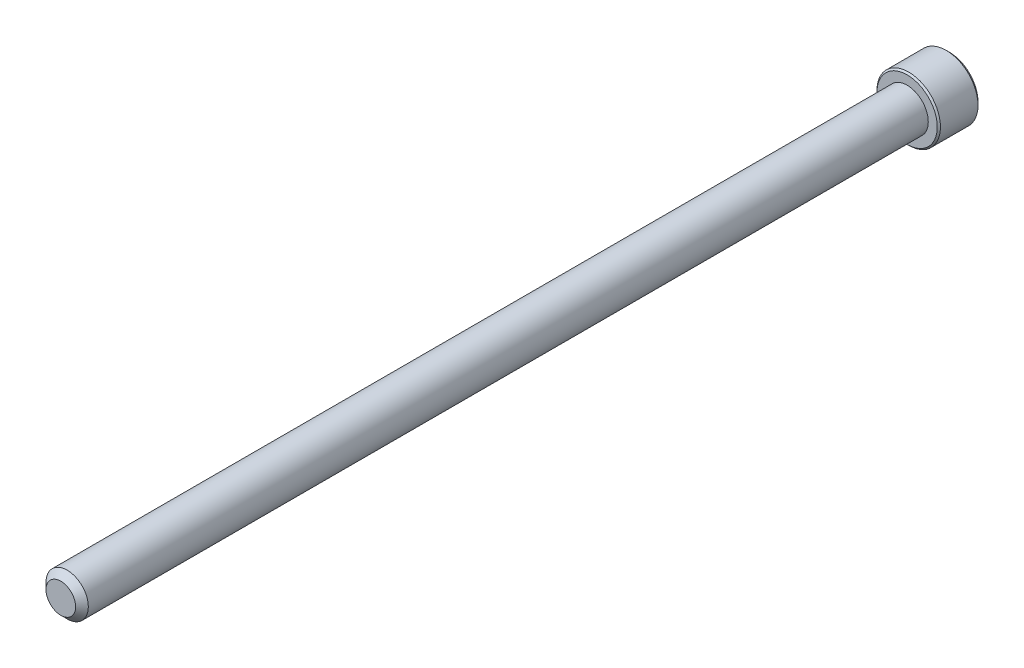
ISO-10303-21;
HEADER;
FILE_DESCRIPTION(('STEP AP214'),'2;1');
FILE_NAME('part.step','',(''),(''),'','','');
FILE_SCHEMA(('AUTOMOTIVE_DESIGN { 1 0 10303 214 1 1 1 1 }'));
ENDSEC;
DATA;
#1=APPLICATION_CONTEXT('core data for automotive mechanical design processes');
#2=APPLICATION_PROTOCOL_DEFINITION('international standard','automotive_design',2000,#1);
#3=PRODUCT_CONTEXT('',#1,'mechanical');
#4=PRODUCT('Part','Part','',(#3));
#5=PRODUCT_RELATED_PRODUCT_CATEGORY('part','',(#4));
#6=PRODUCT_DEFINITION_FORMATION('','',#4);
#7=PRODUCT_DEFINITION_CONTEXT('part definition',#1,'design');
#8=PRODUCT_DEFINITION('design','',#6,#7);
#9=PRODUCT_DEFINITION_SHAPE('','',#8);
#10=(LENGTH_UNIT() NAMED_UNIT(*) SI_UNIT(.MILLI.,.METRE.));
#11=(NAMED_UNIT(*) PLANE_ANGLE_UNIT() SI_UNIT($,.RADIAN.));
#12=(NAMED_UNIT(*) SI_UNIT($,.STERADIAN.) SOLID_ANGLE_UNIT());
#13=UNCERTAINTY_MEASURE_WITH_UNIT(LENGTH_MEASURE(1.E-05),#10,'distance_accuracy_value','');
#14=(GEOMETRIC_REPRESENTATION_CONTEXT(3) GLOBAL_UNCERTAINTY_ASSIGNED_CONTEXT((#13)) GLOBAL_UNIT_ASSIGNED_CONTEXT((#10,
#11,#12)) REPRESENTATION_CONTEXT('',''));
#15=CARTESIAN_POINT('',(0.,0.,0.));
#16=DIRECTION('',(0.,0.,1.));
#17=DIRECTION('',(1.,0.,0.));
#18=AXIS2_PLACEMENT_3D('',#15,#16,#17);
#19=CARTESIAN_POINT('',(0.,0.,-127.));
#20=DIRECTION('',(0.,0.,1.));
#21=DIRECTION('',(1.,0.,0.));
#22=AXIS2_PLACEMENT_3D('',#19,#20,#21);
#23=CYLINDRICAL_SURFACE('',#22,3.175);
#24=CARTESIAN_POINT('',(0.,0.,-0.952499999999995));
#25=DIRECTION('',(0.,0.,1.));
#26=DIRECTION('',(1.,0.,0.));
#27=AXIS2_PLACEMENT_3D('',#24,#25,#26);
#28=CIRCLE('',#27,3.175);
#29=CARTESIAN_POINT('',(3.175,0.,-0.952499999999995));
#30=VERTEX_POINT('',#29);
#31=EDGE_CURVE('E106',#30,#30,#28,.F.);
#32=ORIENTED_EDGE('',*,*,#31,.T.);
#33=EDGE_LOOP('',(#32));
#34=FACE_BOUND('',#33,.T.);
#35=CARTESIAN_POINT('',(0.,0.,-127.));
#36=DIRECTION('',(0.,0.,-1.));
#37=DIRECTION('',(-1.,0.,0.));
#38=AXIS2_PLACEMENT_3D('',#35,#36,#37);
#39=CIRCLE('',#38,3.175);
#40=CARTESIAN_POINT('',(-3.175,0.,-127.));
#41=VERTEX_POINT('',#40);
#42=EDGE_CURVE('E209',#41,#41,#39,.F.);
#43=ORIENTED_EDGE('',*,*,#42,.T.);
#44=EDGE_LOOP('',(#43));
#45=FACE_BOUND('',#44,.T.);
#46=ADVANCED_FACE('F32',(#34,#45),#23,.T.);
#47=CARTESIAN_POINT('',(0.,0.,0.));
#48=DIRECTION('',(0.,0.,1.));
#49=DIRECTION('',(1.,0.,0.));
#50=AXIS2_PLACEMENT_3D('',#47,#48,#49);
#51=PLANE('',#50);
#52=CARTESIAN_POINT('',(0.,0.,0.));
#53=DIRECTION('',(0.,0.,1.));
#54=DIRECTION('',(1.,0.,0.));
#55=AXIS2_PLACEMENT_3D('',#52,#53,#54);
#56=CIRCLE('',#55,2.22250000000002);
#57=CARTESIAN_POINT('',(2.22250000000002,0.,0.));
#58=VERTEX_POINT('',#57);
#59=EDGE_CURVE('E208',#58,#58,#56,.T.);
#60=ORIENTED_EDGE('',*,*,#59,.T.);
#61=EDGE_LOOP('',(#60));
#62=FACE_BOUND('',#61,.T.);
#63=ADVANCED_FACE('F186',(#62),#51,.T.);
#64=CARTESIAN_POINT('',(0.,0.,0.));
#65=DIRECTION('',(0.,0.,-1.));
#66=DIRECTION('',(-1.,0.,0.));
#67=AXIS2_PLACEMENT_3D('',#64,#65,#66);
#68=CONICAL_SURFACE('',#67,2.22250000000002,0.785398163397442);
#69=ORIENTED_EDGE('',*,*,#31,.F.);
#70=EDGE_LOOP('',(#69));
#71=FACE_BOUND('',#70,.T.);
#72=ORIENTED_EDGE('',*,*,#59,.F.);
#73=EDGE_LOOP('',(#72));
#74=FACE_BOUND('',#73,.T.);
#75=ADVANCED_FACE('F192',(#71,#74),#68,.T.);
#76=CARTESIAN_POINT('',(0.,0.,-133.35));
#77=DIRECTION('',(0.,0.,1.));
#78=DIRECTION('',(1.,0.,0.));
#79=AXIS2_PLACEMENT_3D('',#76,#77,#78);
#80=CYLINDRICAL_SURFACE('',#79,4.7625);
#81=CARTESIAN_POINT('',(0.,0.,-127.238125));
#82=DIRECTION('',(0.,0.,-1.));
#83=DIRECTION('',(-1.,0.,0.));
#84=AXIS2_PLACEMENT_3D('',#81,#82,#83);
#85=CIRCLE('',#84,4.7625);
#86=CARTESIAN_POINT('',(-4.7625,0.,-127.238125));
#87=VERTEX_POINT('',#86);
#88=EDGE_CURVE('E40',#87,#87,#85,.T.);
#89=ORIENTED_EDGE('',*,*,#88,.T.);
#90=EDGE_LOOP('',(#89));
#91=FACE_BOUND('',#90,.T.);
#92=CARTESIAN_POINT('',(0.,0.,-132.87375));
#93=DIRECTION('',(0.,0.,-1.));
#94=DIRECTION('',(-1.,0.,0.));
#95=AXIS2_PLACEMENT_3D('',#92,#93,#94);
#96=CIRCLE('',#95,4.7625);
#97=CARTESIAN_POINT('',(4.76250000000001,0.,-132.87375));
#98=VERTEX_POINT('',#97);
#99=EDGE_CURVE('E169',#98,#98,#96,.F.);
#100=ORIENTED_EDGE('',*,*,#99,.T.);
#101=EDGE_LOOP('',(#100));
#102=FACE_BOUND('',#101,.T.);
#103=ADVANCED_FACE('F174',(#91,#102),#80,.T.);
#104=CARTESIAN_POINT('',(0.,0.,-133.35));
#105=DIRECTION('',(0.,0.,-1.));
#106=DIRECTION('',(-1.,0.,0.));
#107=AXIS2_PLACEMENT_3D('',#104,#105,#106);
#108=PLANE('',#107);
#109=CARTESIAN_POINT('',(0.,0.,-133.35));
#110=DIRECTION('',(0.,0.,-1.));
#111=DIRECTION('',(-1.,0.,0.));
#112=AXIS2_PLACEMENT_3D('',#109,#110,#111);
#113=CIRCLE('',#112,4.28625000000001);
#114=CARTESIAN_POINT('',(4.28625000000002,0.,-133.35));
#115=VERTEX_POINT('',#114);
#116=EDGE_CURVE('E105',#115,#115,#113,.T.);
#117=ORIENTED_EDGE('',*,*,#116,.T.);
#118=EDGE_LOOP('',(#117));
#119=FACE_BOUND('',#118,.T.);
#120=CARTESIAN_POINT('',(0.,0.,-133.35));
#121=DIRECTION('',(0.,0.,-1.));
#122=DIRECTION('',(-1.,0.,0.));
#123=AXIS2_PLACEMENT_3D('',#120,#121,#122);
#124=CIRCLE('',#123,2.74963065701559);
#125=CARTESIAN_POINT('',(-2.38125,1.37481532850779,-133.35));
#126=VERTEX_POINT('',#125);
#127=CARTESIAN_POINT('',(0.,2.74963065701559,-133.35));
#128=VERTEX_POINT('',#127);
#129=EDGE_CURVE('E86',#126,#128,#124,.T.);
#130=ORIENTED_EDGE('',*,*,#129,.F.);
#131=CARTESIAN_POINT('',(-2.38125,-1.3748153285078,-133.35));
#132=VERTEX_POINT('',#131);
#133=EDGE_CURVE('E46',#132,#126,#124,.T.);
#134=ORIENTED_EDGE('',*,*,#133,.F.);
#135=CARTESIAN_POINT('',(0.,-2.74963065701559,-133.35));
#136=VERTEX_POINT('',#135);
#137=EDGE_CURVE('E268',#136,#132,#124,.T.);
#138=ORIENTED_EDGE('',*,*,#137,.F.);
#139=CARTESIAN_POINT('',(2.38125,-1.3748153285078,-133.35));
#140=VERTEX_POINT('',#139);
#141=EDGE_CURVE('E53',#140,#136,#124,.T.);
#142=ORIENTED_EDGE('',*,*,#141,.F.);
#143=CARTESIAN_POINT('',(2.38125,1.3748153285078,-133.35));
#144=VERTEX_POINT('',#143);
#145=EDGE_CURVE('E127',#144,#140,#124,.T.);
#146=ORIENTED_EDGE('',*,*,#145,.F.);
#147=EDGE_CURVE('E95',#128,#144,#124,.T.);
#148=ORIENTED_EDGE('',*,*,#147,.F.);
#149=EDGE_LOOP('',(#130,#134,#138,#142,#146,#148));
#150=FACE_BOUND('',#149,.T.);
#151=ADVANCED_FACE('F126',(#119,#150),#108,.T.);
#152=CARTESIAN_POINT('',(0.,0.,-127.));
#153=DIRECTION('',(0.,0.,-1.));
#154=DIRECTION('',(-1.,0.,0.));
#155=AXIS2_PLACEMENT_3D('',#152,#153,#154);
#156=PLANE('',#155);
#157=CARTESIAN_POINT('',(0.,0.,-127.));
#158=DIRECTION('',(0.,0.,-1.));
#159=DIRECTION('',(-1.,0.,0.));
#160=AXIS2_PLACEMENT_3D('',#157,#158,#159);
#161=CIRCLE('',#160,4.524375);
#162=CARTESIAN_POINT('',(-4.524375,0.,-127.));
#163=VERTEX_POINT('',#162);
#164=EDGE_CURVE('E11',#163,#163,#161,.F.);
#165=ORIENTED_EDGE('',*,*,#164,.T.);
#166=EDGE_LOOP('',(#165));
#167=FACE_BOUND('',#166,.T.);
#168=ORIENTED_EDGE('',*,*,#42,.F.);
#169=EDGE_LOOP('',(#168));
#170=FACE_BOUND('',#169,.T.);
#171=ADVANCED_FACE('F280',(#167,#170),#156,.F.);
#172=CARTESIAN_POINT('',(0.,0.,-133.35));
#173=DIRECTION('',(0.,0.,-1.));
#174=DIRECTION('',(-1.,0.,0.));
#175=AXIS2_PLACEMENT_3D('',#172,#173,#174);
#176=CONICAL_SURFACE('',#175,2.74963065701559,0.78539816339745);
#177=ORIENTED_EDGE('',*,*,#147,.T.);
#178=CARTESIAN_POINT('',(-0.000199999999996583,2.74974612706943,-133.350115477327));
#179=CARTESIAN_POINT('',(0.0816567823790509,2.70248609172789,-133.30289489671));
#180=CARTESIAN_POINT('',(0.164882333771762,2.65443579722785,-133.258447575293));
#181=CARTESIAN_POINT('',(0.334588480838041,2.556455907536,-133.177065456986));
#182=CARTESIAN_POINT('',(0.4210852173531,2.50651699342501,-133.140175943095));
#183=CARTESIAN_POINT('',(0.595501774009032,2.40581754748858,-133.076983413166));
#184=CARTESIAN_POINT('',(0.683377171180661,2.35508266327639,-133.050521558729));
#185=CARTESIAN_POINT('',(0.861062594070858,2.25249593653967,-133.009751515616));
#186=CARTESIAN_POINT('',(0.950867191185854,2.20064722822086,-132.995412891531));
#187=CARTESIAN_POINT('',(1.10563960313032,2.11128933452159,-132.98247578477));
#188=CARTESIAN_POINT('',(1.1704074489696,2.07389560129145,-132.980560604653));
#189=CARTESIAN_POINT('',(1.29983727933555,1.9991692538885,-132.983786622768));
#190=CARTESIAN_POINT('',(1.36449921879334,1.96183666573623,-132.988930294857));
#191=CARTESIAN_POINT('',(1.49321254857737,1.88752399013712,-133.005981310872));
#192=CARTESIAN_POINT('',(1.55726317423483,1.85054434417202,-133.017896221349));
#193=CARTESIAN_POINT('',(1.68425683890525,1.77722451768918,-133.047835672352));
#194=CARTESIAN_POINT('',(1.7471999624358,1.74088428837518,-133.065859744518));
#195=CARTESIAN_POINT('',(1.90842615073216,1.64780030516186,-133.119368807552));
#196=CARTESIAN_POINT('',(2.00570949128782,1.59163374230438,-133.158887420872));
#197=CARTESIAN_POINT('',(2.14875606262556,1.50904576583589,-133.225600343551));
#198=CARTESIAN_POINT('',(2.19589628894395,1.4818293434813,-133.249040209111));
#199=CARTESIAN_POINT('',(2.28930352636663,1.42790064981106,-133.29805667666));
#200=CARTESIAN_POINT('',(2.33557105249682,1.40118808114506,-133.323631966767));
#201=CARTESIAN_POINT('',(2.38145,1.37469985845396,-133.350115477327));
#202=B_SPLINE_CURVE_WITH_KNOTS('',3,(#178,#179,#180,#181,#182,#183,#184,#185,#186,#187,#188,
#189,#190,#191,#192,#193,#194,#195,#196,#197,#198,#199,#200,#201),.UNSPECIFIED.,.F.,.F.,(4,2,2,
2,2,2,2,2,2,2,2,4),(0.,0.31719661061195,0.636241461041197,0.950218950629196,1.26340583824123,
1.48752413747841,1.71172100167743,1.93616888974078,2.16059957440833,2.5170963974476,
2.69486147369096,2.87251813383153),.UNSPECIFIED.);
#203=EDGE_CURVE('E100',#128,#144,#202,.T.);
#204=ORIENTED_EDGE('',*,*,#203,.F.);
#205=EDGE_LOOP('',(#177,#204));
#206=FACE_BOUND('',#205,.T.);
#207=ADVANCED_FACE('F101',(#206),#176,.F.);
#208=ORIENTED_EDGE('',*,*,#145,.T.);
#209=CARTESIAN_POINT('',(2.38125,-2.74194290589388,-134.23198089458));
#210=CARTESIAN_POINT('',(2.38125,-2.67517961056041,-134.181584667978));
#211=CARTESIAN_POINT('',(2.38125,-2.60804251112753,-134.131675587591));
#212=CARTESIAN_POINT('',(2.38125,-2.47287325055308,-134.033049830986));
#213=CARTESIAN_POINT('',(2.38125,-2.40484086895313,-133.984333457245));
#214=CARTESIAN_POINT('',(2.38125,-2.26723593505442,-133.887964854453));
#215=CARTESIAN_POINT('',(2.38125,-2.1976555334605,-133.840323795433));
#216=CARTESIAN_POINT('',(2.38125,-2.05731367842205,-133.746819923387));
#217=CARTESIAN_POINT('',(2.38125,-1.98655230892574,-133.700956984729));
#218=CARTESIAN_POINT('',(2.38125,-1.83957751909226,-133.608845900713));
#219=CARTESIAN_POINT('',(2.38125,-1.76328361992076,-133.562725517393));
#220=CARTESIAN_POINT('',(2.38125,-1.6089135770446,-133.473518303891));
#221=CARTESIAN_POINT('',(2.38125,-1.53083712149137,-133.430432009975));
#222=CARTESIAN_POINT('',(2.38125,-1.37291620334514,-133.348226501471));
#223=CARTESIAN_POINT('',(2.38125,-1.29307799938228,-133.309095357852));
#224=CARTESIAN_POINT('',(2.38125,-1.13121425093133,-133.235667950315));
#225=CARTESIAN_POINT('',(2.38125,-1.04918943681796,-133.201370095454));
#226=CARTESIAN_POINT('',(2.38125,-0.88953525675928,-133.141354631416));
#227=CARTESIAN_POINT('',(2.38125,-0.81208386577027,-133.115168478432));
#228=CARTESIAN_POINT('',(2.38125,-0.655316366527676,-133.069009751487));
#229=CARTESIAN_POINT('',(2.38125,-0.576000130216844,-133.049037605584));
#230=CARTESIAN_POINT('',(2.38125,-0.417295761573386,-133.016682145249));
#231=CARTESIAN_POINT('',(2.38125,-0.337934576883857,-133.004168808355));
#232=CARTESIAN_POINT('',(2.38125,-0.178363852969592,-132.986973860166));
#233=CARTESIAN_POINT('',(2.38125,-0.0981544619617754,-132.982290902613));
#234=CARTESIAN_POINT('',(2.38125,0.0594188034321208,-132.981104440839));
#235=CARTESIAN_POINT('',(2.38125,0.136780588525984,-132.984311010505));
#236=CARTESIAN_POINT('',(2.38125,0.290840960607331,-132.998087056743));
#237=CARTESIAN_POINT('',(2.38125,0.367539482435403,-133.008657248587));
#238=CARTESIAN_POINT('',(2.38125,0.521017492835381,-133.036762829853));
#239=CARTESIAN_POINT('',(2.38125,0.597774958394039,-133.054416748931));
#240=CARTESIAN_POINT('',(2.38125,0.749609814256998,-133.095751396243));
#241=CARTESIAN_POINT('',(2.38125,0.824687344568015,-133.11943162019));
#242=CARTESIAN_POINT('',(2.38125,1.06107814410024,-133.202894862956));
#243=CARTESIAN_POINT('',(2.38125,1.21904786221807,-133.27218392704));
#244=CARTESIAN_POINT('',(2.38125,1.45021000267339,-133.38766408386));
#245=CARTESIAN_POINT('',(2.38125,1.52644290442583,-133.428173057258));
#246=CARTESIAN_POINT('',(2.38125,1.6771761853817,-133.512302689237));
#247=CARTESIAN_POINT('',(2.38125,1.75167687358837,-133.5559227871));
#248=CARTESIAN_POINT('',(2.38125,1.89548152088325,-133.643412556489));
#249=CARTESIAN_POINT('',(2.38125,1.96485959608996,-133.687161792742));
#250=CARTESIAN_POINT('',(2.38125,2.10242624411167,-133.776501158731));
#251=CARTESIAN_POINT('',(2.38125,2.17061472626631,-133.822091427904));
#252=CARTESIAN_POINT('',(2.38125,2.30540317317351,-133.914406005093));
#253=CARTESIAN_POINT('',(2.38125,2.37201154222164,-133.961118092896));
#254=CARTESIAN_POINT('',(2.38125,2.50431800054456,-134.055777578018));
#255=CARTESIAN_POINT('',(2.38125,2.57001633510789,-134.103724632096));
#256=CARTESIAN_POINT('',(2.38125,2.63533378855943,-134.152176733542));
#257=B_SPLINE_CURVE_WITH_KNOTS('',3,(#209,#210,#211,#212,#213,#214,#215,#216,#217,#218,#219,
#220,#221,#222,#223,#224,#225,#226,#227,#228,#229,#230,#231,#232,#233,#234,#235,#236,#237,#238,
#239,#240,#241,#242,#243,#244,#245,#246,#247,#248,#249,#250,#251,#252,#253,#254,#255,#256),
.UNSPECIFIED.,.F.,.F.,(4,2,2,2,2,2,2,2,2,2,2,2,2,2,2,2,2,2,2,2,2,2,2,4),(0.,0.250951284009991,
0.501965564827891,0.754924775973589,1.00786608164542,1.27526207798892,1.54270521780083,
1.8093160202934,2.07583885812519,2.32089852590463,2.56597507114535,2.80664400307698,
3.04727155311265,3.27918940971451,3.51112979698762,3.74712477407483,3.98310000940111,
4.49898139184703,4.75794323931353,5.01685853149445,5.26288960015359,5.5089393379467,
5.7529903839714,5.99697431627966),.UNSPECIFIED.);
#258=EDGE_CURVE('E94',#144,#140,#257,.F.);
#259=ORIENTED_EDGE('',*,*,#258,.F.);
#260=EDGE_LOOP('',(#208,#259));
#261=FACE_BOUND('',#260,.T.);
#262=ADVANCED_FACE('F274',(#261),#176,.F.);
#263=ORIENTED_EDGE('',*,*,#141,.T.);
#264=CARTESIAN_POINT('',(2.38145,-1.37469985845396,-133.350115477327));
#265=CARTESIAN_POINT('',(2.29959321762095,-1.4219598937955,-133.30289489671));
#266=CARTESIAN_POINT('',(2.21636766622824,-1.47001018829554,-133.258447575293));
#267=CARTESIAN_POINT('',(2.04666151916196,-1.56799007798739,-133.177065456986));
#268=CARTESIAN_POINT('',(1.96016478264691,-1.61792899209838,-133.140175943095));
#269=CARTESIAN_POINT('',(1.78574822599097,-1.71862843803481,-133.076983413166));
#270=CARTESIAN_POINT('',(1.69787282881934,-1.76936332224699,-133.050521558729));
#271=CARTESIAN_POINT('',(1.52018740592914,-1.87195004898372,-133.009751515616));
#272=CARTESIAN_POINT('',(1.43038280881415,-1.92379875730253,-132.995412891531));
#273=CARTESIAN_POINT('',(1.27561039686968,-2.0131566510018,-132.98247578477));
#274=CARTESIAN_POINT('',(1.2108425510304,-2.05055038423194,-132.980560604653));
#275=CARTESIAN_POINT('',(1.08141272066445,-2.12527673163489,-132.983786622768));
#276=CARTESIAN_POINT('',(1.01675078120667,-2.16260931978716,-132.988930294857));
#277=CARTESIAN_POINT('',(0.888037451422627,-2.23692199538627,-133.005981310872));
#278=CARTESIAN_POINT('',(0.823986825765171,-2.27390164135137,-133.017896221349));
#279=CARTESIAN_POINT('',(0.696993161094752,-2.34722146783421,-133.047835672352));
#280=CARTESIAN_POINT('',(0.634050037564199,-2.38356169714821,-133.065859744518));
#281=CARTESIAN_POINT('',(0.472823849267838,-2.47664568036153,-133.119368807552));
#282=CARTESIAN_POINT('',(0.375540508712179,-2.53281224321901,-133.158887420872));
#283=CARTESIAN_POINT('',(0.232493937374446,-2.6154002196875,-133.225600343551));
#284=CARTESIAN_POINT('',(0.18535371105605,-2.64261664204209,-133.249040209111));
#285=CARTESIAN_POINT('',(0.0919464736333711,-2.69654533571233,-133.29805667666));
#286=CARTESIAN_POINT('',(0.0456789475031842,-2.72325790437833,-133.323631966767));
#287=CARTESIAN_POINT('',(-0.000199999999996122,-2.74974612706943,-133.350115477327));
#288=B_SPLINE_CURVE_WITH_KNOTS('',3,(#264,#265,#266,#267,#268,#269,#270,#271,#272,#273,#274,
#275,#276,#277,#278,#279,#280,#281,#282,#283,#284,#285,#286,#287),.UNSPECIFIED.,.F.,.F.,(4,2,2,
2,2,2,2,2,2,2,2,4),(0.,0.317196610611947,0.63624146104119,0.950218950629192,1.26340583824123,
1.48752413747841,1.71172100167743,1.93616888974078,2.16059957440832,2.5170963974476,
2.69486147369096,2.87251813383152),.UNSPECIFIED.);
#289=EDGE_CURVE('E137',#140,#136,#288,.T.);
#290=ORIENTED_EDGE('',*,*,#289,.F.);
#291=EDGE_LOOP('',(#263,#290));
#292=FACE_BOUND('',#291,.T.);
#293=ADVANCED_FACE('F271',(#292),#176,.F.);
#294=ORIENTED_EDGE('',*,*,#137,.T.);
#295=CARTESIAN_POINT('',(0.000199999999997515,-2.74974612706943,-133.350115477327));
#296=CARTESIAN_POINT('',(-0.0816567823790494,-2.70248609172789,-133.30289489671));
#297=CARTESIAN_POINT('',(-0.16488233377176,-2.65443579722785,-133.258447575293));
#298=CARTESIAN_POINT('',(-0.334588480838036,-2.55645590753601,-133.177065456986));
#299=CARTESIAN_POINT('',(-0.421085217353094,-2.50651699342501,-133.140175943095));
#300=CARTESIAN_POINT('',(-0.595501774009025,-2.40581754748858,-133.076983413166));
#301=CARTESIAN_POINT('',(-0.683377171180655,-2.3550826632764,-133.050521558729));
#302=CARTESIAN_POINT('',(-0.861062594070855,-2.25249593653967,-133.009751515616));
#303=CARTESIAN_POINT('',(-0.950867191185853,-2.20064722822086,-132.995412891531));
#304=CARTESIAN_POINT('',(-1.10563960313032,-2.11128933452159,-132.98247578477));
#305=CARTESIAN_POINT('',(-1.1704074489696,-2.07389560129145,-132.980560604653));
#306=CARTESIAN_POINT('',(-1.29983727933555,-1.9991692538885,-132.983786622768));
#307=CARTESIAN_POINT('',(-1.36449921879333,-1.96183666573623,-132.988930294857));
#308=CARTESIAN_POINT('',(-1.49321254857737,-1.88752399013712,-133.005981310872));
#309=CARTESIAN_POINT('',(-1.55726317423483,-1.85054434417202,-133.017896221349));
#310=CARTESIAN_POINT('',(-1.68425683890525,-1.77722451768918,-133.047835672352));
#311=CARTESIAN_POINT('',(-1.7471999624358,-1.74088428837518,-133.065859744518));
#312=CARTESIAN_POINT('',(-1.90842615073216,-1.64780030516186,-133.119368807552));
#313=CARTESIAN_POINT('',(-2.00570949128782,-1.59163374230438,-133.158887420872));
#314=CARTESIAN_POINT('',(-2.14875606262556,-1.50904576583589,-133.225600343551));
#315=CARTESIAN_POINT('',(-2.19589628894395,-1.4818293434813,-133.249040209111));
#316=CARTESIAN_POINT('',(-2.28930352636663,-1.42790064981106,-133.29805667666));
#317=CARTESIAN_POINT('',(-2.33557105249682,-1.40118808114506,-133.323631966767));
#318=CARTESIAN_POINT('',(-2.38145,-1.37469985845396,-133.350115477327));
#319=B_SPLINE_CURVE_WITH_KNOTS('',3,(#295,#296,#297,#298,#299,#300,#301,#302,#303,#304,#305,
#306,#307,#308,#309,#310,#311,#312,#313,#314,#315,#316,#317,#318),.UNSPECIFIED.,.F.,.F.,(4,2,2,
2,2,2,2,2,2,2,2,4),(0.,0.317196610611948,0.63624146104119,0.950218950629193,1.26340583824123,
1.48752413747841,1.71172100167744,1.93616888974078,2.16059957440833,2.5170963974476,
2.69486147369096,2.87251813383153),.UNSPECIFIED.);
#320=EDGE_CURVE('E245',#136,#132,#319,.T.);
#321=ORIENTED_EDGE('',*,*,#320,.F.);
#322=EDGE_LOOP('',(#294,#321));
#323=FACE_BOUND('',#322,.T.);
#324=ADVANCED_FACE('F270',(#323),#176,.F.);
#325=ORIENTED_EDGE('',*,*,#133,.T.);
#326=CARTESIAN_POINT('',(-2.38125,-2.74194290629279,-134.231980894881));
#327=CARTESIAN_POINT('',(-2.38125,-2.67517961094814,-134.181584668268));
#328=CARTESIAN_POINT('',(-2.38125,-2.60804251150404,-134.131675587869));
#329=CARTESIAN_POINT('',(-2.38125,-2.47287325090702,-134.033049831241));
#330=CARTESIAN_POINT('',(-2.38125,-2.40484086929573,-133.984333457488));
#331=CARTESIAN_POINT('',(-2.38125,-2.26723593537395,-133.887964854674));
#332=CARTESIAN_POINT('',(-2.38125,-2.1976555337683,-133.840323795641));
#333=CARTESIAN_POINT('',(-2.38125,-2.05731367870618,-133.746819923572));
#334=CARTESIAN_POINT('',(-2.38125,-1.98655230919794,-133.700956984903));
#335=CARTESIAN_POINT('',(-2.38125,-1.83957751933872,-133.608845900864));
#336=CARTESIAN_POINT('',(-2.38125,-1.76328362015337,-133.562725517531));
#337=CARTESIAN_POINT('',(-2.38125,-1.60891357724904,-133.473518304005));
#338=CARTESIAN_POINT('',(-2.38125,-1.53083712168147,-133.430432010078));
#339=CARTESIAN_POINT('',(-2.38125,-1.37291620350605,-133.348226501551));
#340=CARTESIAN_POINT('',(-2.38125,-1.29307799952834,-133.309095357921));
#341=CARTESIAN_POINT('',(-2.38125,-1.13121425104689,-133.235667950364));
#342=CARTESIAN_POINT('',(-2.38125,-1.04918943691787,-133.201370095494));
#343=CARTESIAN_POINT('',(-2.38125,-0.889535256852427,-133.141354631448));
#344=CARTESIAN_POINT('',(-2.38125,-0.812083865872991,-133.115168478466));
#345=CARTESIAN_POINT('',(-2.38125,-0.655316366649855,-133.06900975152));
#346=CARTESIAN_POINT('',(-2.38125,-0.576000130348907,-133.049037605615));
#347=CARTESIAN_POINT('',(-2.38125,-0.417295761724894,-133.016682145275));
#348=CARTESIAN_POINT('',(-2.38125,-0.33793457704492,-133.004168808378));
#349=CARTESIAN_POINT('',(-2.38125,-0.178363853149445,-132.98697386018));
#350=CARTESIAN_POINT('',(-2.38125,-0.0981544621508634,-132.982290902621));
#351=CARTESIAN_POINT('',(-2.38125,0.0594188032259959,-132.981104440834));
#352=CARTESIAN_POINT('',(-2.38125,0.136780588312034,-132.984311010493));
#353=CARTESIAN_POINT('',(-2.38125,0.290840960378509,-132.998087056715));
#354=CARTESIAN_POINT('',(-2.38125,0.367539482199536,-133.008657248551));
#355=CARTESIAN_POINT('',(-2.38125,0.521017492585612,-133.036762829799));
#356=CARTESIAN_POINT('',(-2.38125,0.597774958137435,-133.054416748869));
#357=CARTESIAN_POINT('',(-2.38125,0.749609813987379,-133.095751396163));
#358=CARTESIAN_POINT('',(-2.38125,0.824687344292217,-133.1194316201));
#359=CARTESIAN_POINT('',(-2.38125,1.06107814376438,-133.202894862822));
#360=CARTESIAN_POINT('',(-2.38125,1.21904786183133,-133.272183926865));
#361=CARTESIAN_POINT('',(-2.38125,1.45021000221338,-133.387664083621));
#362=CARTESIAN_POINT('',(-2.38125,1.52644290394182,-133.428173056997));
#363=CARTESIAN_POINT('',(-2.38125,1.67717618485049,-133.512302688931));
#364=CARTESIAN_POINT('',(-2.38125,1.75167687303394,-133.555922786771));
#365=CARTESIAN_POINT('',(-2.38125,1.89548152028662,-133.643412556118));
#366=CARTESIAN_POINT('',(-2.38125,1.96485959547427,-133.68716179235));
#367=CARTESIAN_POINT('',(-2.38125,2.10242624345813,-133.776501158298));
#368=CARTESIAN_POINT('',(-2.38125,2.17061472559398,-133.822091427451));
#369=CARTESIAN_POINT('',(-2.38125,2.30540317246406,-133.9144060046));
#370=CARTESIAN_POINT('',(-2.38125,2.37201154149385,-133.961118092383));
#371=CARTESIAN_POINT('',(-2.38125,2.50431799978022,-134.055777577464));
#372=CARTESIAN_POINT('',(-2.38125,2.57001633432534,-134.103724631522));
#373=CARTESIAN_POINT('',(-2.38125,2.6353337877587,-134.152176732948));
#374=B_SPLINE_CURVE_WITH_KNOTS('',3,(#326,#327,#328,#329,#330,#331,#332,#333,#334,#335,#336,
#337,#338,#339,#340,#341,#342,#343,#344,#345,#346,#347,#348,#349,#350,#351,#352,#353,#354,#355,
#356,#357,#358,#359,#360,#361,#362,#363,#364,#365,#366,#367,#368,#369,#370,#371,#372,#373),
.UNSPECIFIED.,.F.,.F.,(4,2,2,2,2,2,2,2,2,2,2,2,2,2,2,2,2,2,2,2,2,2,2,4),(0.,0.250951284057738,
0.501965564923416,0.754924776117798,1.00786608183831,1.27526207823638,1.5427052181029,
1.8093160206496,2.07583885853548,2.32089852628724,2.56597507150033,2.80664400340545,
3.04727155341461,3.27918940999222,3.51112979724106,3.74712477430213,3.9831000096023,
4.49898139186042,4.75794323923237,5.01685853131879,5.26288959989708,5.50893933760931,
5.75299038355423,5.99697431578276),.UNSPECIFIED.);
#375=EDGE_CURVE('E116',#132,#126,#374,.T.);
#376=ORIENTED_EDGE('',*,*,#375,.F.);
#377=EDGE_LOOP('',(#325,#376));
#378=FACE_BOUND('',#377,.T.);
#379=ADVANCED_FACE('F287',(#378),#176,.F.);
#380=ORIENTED_EDGE('',*,*,#129,.T.);
#381=CARTESIAN_POINT('',(-2.38145,1.37469985845396,-133.350115477327));
#382=CARTESIAN_POINT('',(-2.29959321762095,1.4219598937955,-133.30289489671));
#383=CARTESIAN_POINT('',(-2.21636766622824,1.47001018829554,-133.258447575293));
#384=CARTESIAN_POINT('',(-2.04666151916196,1.56799007798738,-133.177065456986));
#385=CARTESIAN_POINT('',(-1.96016478264691,1.61792899209838,-133.140175943095));
#386=CARTESIAN_POINT('',(-1.78574822599097,1.71862843803481,-133.076983413166));
#387=CARTESIAN_POINT('',(-1.69787282881935,1.76936332224699,-133.050521558729));
#388=CARTESIAN_POINT('',(-1.52018740592914,1.87195004898372,-133.009751515616));
#389=CARTESIAN_POINT('',(-1.43038280881415,1.92379875730253,-132.995412891531));
#390=CARTESIAN_POINT('',(-1.27561039686968,2.0131566510018,-132.98247578477));
#391=CARTESIAN_POINT('',(-1.2108425510304,2.05055038423194,-132.980560604653));
#392=CARTESIAN_POINT('',(-1.08141272066445,2.12527673163489,-132.983786622768));
#393=CARTESIAN_POINT('',(-1.01675078120667,2.16260931978716,-132.988930294857));
#394=CARTESIAN_POINT('',(-0.888037451422626,2.23692199538627,-133.005981310872));
#395=CARTESIAN_POINT('',(-0.82398682576517,2.27390164135137,-133.017896221349));
#396=CARTESIAN_POINT('',(-0.696993161094751,2.34722146783421,-133.047835672352));
#397=CARTESIAN_POINT('',(-0.634050037564199,2.38356169714821,-133.065859744518));
#398=CARTESIAN_POINT('',(-0.472823849267842,2.47664568036153,-133.119368807552));
#399=CARTESIAN_POINT('',(-0.375540508712189,2.532812243219,-133.158887420872));
#400=CARTESIAN_POINT('',(-0.232493937374456,2.61540021968749,-133.225600343551));
#401=CARTESIAN_POINT('',(-0.185353711056057,2.64261664204208,-133.249040209111));
#402=CARTESIAN_POINT('',(-0.091946473633373,2.69654533571233,-133.29805667666));
#403=CARTESIAN_POINT('',(-0.0456789475031839,2.72325790437833,-133.323631966767));
#404=CARTESIAN_POINT('',(0.000199999999998009,2.74974612706943,-133.350115477327));
#405=B_SPLINE_CURVE_WITH_KNOTS('',3,(#381,#382,#383,#384,#385,#386,#387,#388,#389,#390,#391,
#392,#393,#394,#395,#396,#397,#398,#399,#400,#401,#402,#403,#404),.UNSPECIFIED.,.F.,.F.,(4,2,2,
2,2,2,2,2,2,2,2,4),(0.,0.317196610611947,0.63624146104119,0.950218950629193,1.26340583824123,
1.48752413747841,1.71172100167744,1.93616888974078,2.16059957440833,2.51709639744759,
2.69486147369096,2.87251813383153),.UNSPECIFIED.);
#406=EDGE_CURVE('E90',#126,#128,#405,.T.);
#407=ORIENTED_EDGE('',*,*,#406,.F.);
#408=EDGE_LOOP('',(#380,#407));
#409=FACE_BOUND('',#408,.T.);
#410=ADVANCED_FACE('F88',(#409),#176,.F.);
#411=CARTESIAN_POINT('',(2.38125,4.12444598552339,-129.778125));
#412=DIRECTION('',(0.,0.,-1.));
#413=DIRECTION('',(-1.,0.,0.));
#414=AXIS2_PLACEMENT_3D('',#411,#412,#413);
#415=PLANE('',#414);
#416=DIRECTION('',(0.866025403784439,0.5,0.));
#417=VECTOR('',#416,1.);
#418=CARTESIAN_POINT('',(-2.38125,1.3748153285078,-129.778125));
#419=LINE('',#418,#417);
#420=CARTESIAN_POINT('',(-2.38125,1.3748153285078,-129.778125));
#421=VERTEX_POINT('',#420);
#422=CARTESIAN_POINT('',(0.,2.74963065701559,-129.778125));
#423=VERTEX_POINT('',#422);
#424=EDGE_CURVE('E115',#421,#423,#419,.T.);
#425=ORIENTED_EDGE('',*,*,#424,.T.);
#426=DIRECTION('',(0.866025403784439,-0.5,0.));
#427=VECTOR('',#426,1.);
#428=CARTESIAN_POINT('',(0.,2.74963065701559,-129.778125));
#429=LINE('',#428,#427);
#430=CARTESIAN_POINT('',(2.38125,1.3748153285078,-129.778125));
#431=VERTEX_POINT('',#430);
#432=EDGE_CURVE('E120',#423,#431,#429,.T.);
#433=ORIENTED_EDGE('',*,*,#432,.T.);
#434=DIRECTION('',(0.,-1.,0.));
#435=VECTOR('',#434,1.);
#436=CARTESIAN_POINT('',(2.38125,1.3748153285078,-129.778125));
#437=LINE('',#436,#435);
#438=CARTESIAN_POINT('',(2.38125,-1.3748153285078,-129.778125));
#439=VERTEX_POINT('',#438);
#440=EDGE_CURVE('E231',#431,#439,#437,.T.);
#441=ORIENTED_EDGE('',*,*,#440,.T.);
#442=DIRECTION('',(-0.866025403784439,-0.5,0.));
#443=VECTOR('',#442,1.);
#444=CARTESIAN_POINT('',(2.38125,-1.3748153285078,-129.778125));
#445=LINE('',#444,#443);
#446=CARTESIAN_POINT('',(0.,-2.74963065701559,-129.778125));
#447=VERTEX_POINT('',#446);
#448=EDGE_CURVE('E228',#439,#447,#445,.T.);
#449=ORIENTED_EDGE('',*,*,#448,.T.);
#450=DIRECTION('',(-0.866025403784439,0.5,0.));
#451=VECTOR('',#450,1.);
#452=CARTESIAN_POINT('',(0.,-2.74963065701559,-129.778125));
#453=LINE('',#452,#451);
#454=CARTESIAN_POINT('',(-2.38125,-1.3748153285078,-129.778125));
#455=VERTEX_POINT('',#454);
#456=EDGE_CURVE('E225',#447,#455,#453,.T.);
#457=ORIENTED_EDGE('',*,*,#456,.T.);
#458=DIRECTION('',(0.,1.,0.));
#459=VECTOR('',#458,1.);
#460=CARTESIAN_POINT('',(-2.38125,-1.3748153285078,-129.778125));
#461=LINE('',#460,#459);
#462=EDGE_CURVE('E123',#455,#421,#461,.T.);
#463=ORIENTED_EDGE('',*,*,#462,.T.);
#464=EDGE_LOOP('',(#425,#433,#441,#449,#457,#463));
#465=FACE_BOUND('',#464,.T.);
#466=ADVANCED_FACE('F157',(#465),#415,.T.);
#467=CARTESIAN_POINT('',(0.,2.74963065701559,-129.778125));
#468=DIRECTION('',(0.5,0.866025403784439,0.));
#469=DIRECTION('',(-0.866025403784439,0.5,0.));
#470=AXIS2_PLACEMENT_3D('',#467,#468,#469);
#471=PLANE('',#470);
#472=DIRECTION('',(0.,0.,-1.));
#473=VECTOR('',#472,1.);
#474=CARTESIAN_POINT('',(0.,2.74963065701559,-129.778125));
#475=LINE('',#474,#473);
#476=EDGE_CURVE('E112',#423,#128,#475,.T.);
#477=ORIENTED_EDGE('',*,*,#476,.T.);
#478=ORIENTED_EDGE('',*,*,#203,.T.);
#479=DIRECTION('',(0.,0.,-1.));
#480=VECTOR('',#479,1.);
#481=CARTESIAN_POINT('',(2.38125,1.3748153285078,-129.778125));
#482=LINE('',#481,#480);
#483=EDGE_CURVE('E122',#431,#144,#482,.T.);
#484=ORIENTED_EDGE('',*,*,#483,.F.);
#485=ORIENTED_EDGE('',*,*,#432,.F.);
#486=EDGE_LOOP('',(#477,#478,#484,#485));
#487=FACE_BOUND('',#486,.T.);
#488=ADVANCED_FACE('F118',(#487),#471,.F.);
#489=CARTESIAN_POINT('',(2.38125,1.3748153285078,-129.778125));
#490=DIRECTION('',(1.,0.,0.));
#491=DIRECTION('',(0.,1.,0.));
#492=AXIS2_PLACEMENT_3D('',#489,#490,#491);
#493=PLANE('',#492);
#494=ORIENTED_EDGE('',*,*,#483,.T.);
#495=ORIENTED_EDGE('',*,*,#258,.T.);
#496=DIRECTION('',(0.,0.,-1.));
#497=VECTOR('',#496,1.);
#498=CARTESIAN_POINT('',(2.38125,-1.3748153285078,-129.778125));
#499=LINE('',#498,#497);
#500=EDGE_CURVE('E214',#439,#140,#499,.T.);
#501=ORIENTED_EDGE('',*,*,#500,.F.);
#502=ORIENTED_EDGE('',*,*,#440,.F.);
#503=EDGE_LOOP('',(#494,#495,#501,#502));
#504=FACE_BOUND('',#503,.T.);
#505=ADVANCED_FACE('F146',(#504),#493,.F.);
#506=CARTESIAN_POINT('',(2.38125,-1.3748153285078,-129.778125));
#507=DIRECTION('',(0.5,-0.866025403784439,0.));
#508=DIRECTION('',(0.866025403784439,0.5,0.));
#509=AXIS2_PLACEMENT_3D('',#506,#507,#508);
#510=PLANE('',#509);
#511=ORIENTED_EDGE('',*,*,#500,.T.);
#512=ORIENTED_EDGE('',*,*,#289,.T.);
#513=DIRECTION('',(0.,0.,-1.));
#514=VECTOR('',#513,1.);
#515=CARTESIAN_POINT('',(0.,-2.74963065701559,-129.778125));
#516=LINE('',#515,#514);
#517=EDGE_CURVE('E217',#447,#136,#516,.T.);
#518=ORIENTED_EDGE('',*,*,#517,.F.);
#519=ORIENTED_EDGE('',*,*,#448,.F.);
#520=EDGE_LOOP('',(#511,#512,#518,#519));
#521=FACE_BOUND('',#520,.T.);
#522=ADVANCED_FACE('F150',(#521),#510,.F.);
#523=CARTESIAN_POINT('',(0.,-2.74963065701559,-129.778125));
#524=DIRECTION('',(-0.5,-0.866025403784439,0.));
#525=DIRECTION('',(0.866025403784439,-0.5,0.));
#526=AXIS2_PLACEMENT_3D('',#523,#524,#525);
#527=PLANE('',#526);
#528=ORIENTED_EDGE('',*,*,#517,.T.);
#529=ORIENTED_EDGE('',*,*,#320,.T.);
#530=DIRECTION('',(0.,0.,-1.));
#531=VECTOR('',#530,1.);
#532=CARTESIAN_POINT('',(-2.38125,-1.3748153285078,-129.778125));
#533=LINE('',#532,#531);
#534=EDGE_CURVE('E220',#455,#132,#533,.T.);
#535=ORIENTED_EDGE('',*,*,#534,.F.);
#536=ORIENTED_EDGE('',*,*,#456,.F.);
#537=EDGE_LOOP('',(#528,#529,#535,#536));
#538=FACE_BOUND('',#537,.T.);
#539=ADVANCED_FACE('F253',(#538),#527,.F.);
#540=CARTESIAN_POINT('',(-2.38125,-1.3748153285078,-129.778125));
#541=DIRECTION('',(-1.,0.,0.));
#542=DIRECTION('',(0.,-1.,0.));
#543=AXIS2_PLACEMENT_3D('',#540,#541,#542);
#544=PLANE('',#543);
#545=ORIENTED_EDGE('',*,*,#534,.T.);
#546=ORIENTED_EDGE('',*,*,#375,.T.);
#547=DIRECTION('',(0.,0.,-1.));
#548=VECTOR('',#547,1.);
#549=CARTESIAN_POINT('',(-2.38125,1.3748153285078,-129.778125));
#550=LINE('',#549,#548);
#551=EDGE_CURVE('E114',#421,#126,#550,.T.);
#552=ORIENTED_EDGE('',*,*,#551,.F.);
#553=ORIENTED_EDGE('',*,*,#462,.F.);
#554=EDGE_LOOP('',(#545,#546,#552,#553));
#555=FACE_BOUND('',#554,.T.);
#556=ADVANCED_FACE('F250',(#555),#544,.F.);
#557=CARTESIAN_POINT('',(-2.38125,1.3748153285078,-129.778125));
#558=DIRECTION('',(-0.5,0.866025403784439,0.));
#559=DIRECTION('',(-0.866025403784439,-0.5,0.));
#560=AXIS2_PLACEMENT_3D('',#557,#558,#559);
#561=PLANE('',#560);
#562=ORIENTED_EDGE('',*,*,#551,.T.);
#563=ORIENTED_EDGE('',*,*,#406,.T.);
#564=ORIENTED_EDGE('',*,*,#476,.F.);
#565=ORIENTED_EDGE('',*,*,#424,.F.);
#566=EDGE_LOOP('',(#562,#563,#564,#565));
#567=FACE_BOUND('',#566,.T.);
#568=ADVANCED_FACE('F110',(#567),#561,.F.);
#569=CARTESIAN_POINT('',(0.,0.,-133.35));
#570=DIRECTION('',(0.,0.,1.));
#571=DIRECTION('',(1.,0.,0.));
#572=AXIS2_PLACEMENT_3D('',#569,#570,#571);
#573=CONICAL_SURFACE('',#572,4.28625000000001,0.785398163397431);
#574=CARTESIAN_POINT('',(4.76250000000001,0.,-132.87375));
#575=CARTESIAN_POINT('',(4.75753906250001,0.,-132.8787109375));
#576=CARTESIAN_POINT('',(4.75257812500001,0.,-132.883671875));
#577=CARTESIAN_POINT('',(4.74265625000001,0.,-132.89359375));
#578=CARTESIAN_POINT('',(4.73769531250001,0.,-132.8985546875));
#579=CARTESIAN_POINT('',(4.72777343750001,0.,-132.9084765625));
#580=CARTESIAN_POINT('',(4.72281250000001,0.,-132.9134375));
#581=CARTESIAN_POINT('',(4.71289062500001,0.,-132.923359375));
#582=CARTESIAN_POINT('',(4.70792968750001,0.,-132.9283203125));
#583=CARTESIAN_POINT('',(4.69800781250002,0.,-132.9382421875));
#584=CARTESIAN_POINT('',(4.69304687500002,0.,-132.943203125));
#585=CARTESIAN_POINT('',(4.68312500000002,0.,-132.953125));
#586=CARTESIAN_POINT('',(4.67816406250001,0.,-132.9580859375));
#587=CARTESIAN_POINT('',(4.66824218750001,0.,-132.9680078125));
#588=CARTESIAN_POINT('',(4.66328125000001,0.,-132.97296875));
#589=CARTESIAN_POINT('',(4.65335937500002,0.,-132.982890625));
#590=CARTESIAN_POINT('',(4.64839843750002,0.,-132.9878515625));
#591=CARTESIAN_POINT('',(4.63847656250002,0.,-132.9977734375));
#592=CARTESIAN_POINT('',(4.63351562500001,0.,-133.002734375));
#593=CARTESIAN_POINT('',(4.62359375000002,0.,-133.01265625));
#594=CARTESIAN_POINT('',(4.61863281250002,0.,-133.0176171875));
#595=CARTESIAN_POINT('',(4.60871093750002,0.,-133.0275390625));
#596=CARTESIAN_POINT('',(4.60375000000001,0.,-133.0325));
#597=CARTESIAN_POINT('',(4.59382812500001,0.,-133.042421875));
#598=CARTESIAN_POINT('',(4.58886718750002,0.,-133.0473828125));
#599=CARTESIAN_POINT('',(4.57894531250002,0.,-133.0573046875));
#600=CARTESIAN_POINT('',(4.57398437500002,0.,-133.062265625));
#601=CARTESIAN_POINT('',(4.56406250000002,0.,-133.0721875));
#602=CARTESIAN_POINT('',(4.55910156250002,0.,-133.0771484375));
#603=CARTESIAN_POINT('',(4.54917968750002,0.,-133.0870703125));
#604=CARTESIAN_POINT('',(4.54421875000001,0.,-133.09203125));
#605=CARTESIAN_POINT('',(4.53429687500002,0.,-133.101953125));
#606=CARTESIAN_POINT('',(4.52933593750002,0.,-133.1069140625));
#607=CARTESIAN_POINT('',(4.51941406250002,0.,-133.1168359375));
#608=CARTESIAN_POINT('',(4.51445312500002,0.,-133.121796875));
#609=CARTESIAN_POINT('',(4.50453125000001,0.,-133.13171875));
#610=CARTESIAN_POINT('',(4.49957031250002,0.,-133.1366796875));
#611=CARTESIAN_POINT('',(4.48964843750002,0.,-133.1466015625));
#612=CARTESIAN_POINT('',(4.48468750000002,0.,-133.1515625));
#613=CARTESIAN_POINT('',(4.47476562500002,0.,-133.161484375));
#614=CARTESIAN_POINT('',(4.46980468750002,0.,-133.1664453125));
#615=CARTESIAN_POINT('',(4.45988281250002,0.,-133.1763671875));
#616=CARTESIAN_POINT('',(4.45492187500002,0.,-133.181328125));
#617=CARTESIAN_POINT('',(4.44500000000002,0.,-133.19125));
#618=CARTESIAN_POINT('',(4.44003906250002,0.,-133.1962109375));
#619=CARTESIAN_POINT('',(4.43011718750001,0.,-133.2061328125));
#620=CARTESIAN_POINT('',(4.42515625000002,0.,-133.21109375));
#621=CARTESIAN_POINT('',(4.41523437500002,0.,-133.221015625));
#622=CARTESIAN_POINT('',(4.41027343750002,0.,-133.2259765625));
#623=CARTESIAN_POINT('',(4.40035156250002,0.,-133.2358984375));
#624=CARTESIAN_POINT('',(4.39539062500002,0.,-133.240859375));
#625=CARTESIAN_POINT('',(4.38546875000002,0.,-133.25078125));
#626=CARTESIAN_POINT('',(4.38050781250002,0.,-133.2557421875));
#627=CARTESIAN_POINT('',(4.37058593750002,0.,-133.2656640625));
#628=CARTESIAN_POINT('',(4.36562500000002,0.,-133.270625));
#629=CARTESIAN_POINT('',(4.35570312500002,0.,-133.280546875));
#630=CARTESIAN_POINT('',(4.35074218750002,0.,-133.2855078125));
#631=CARTESIAN_POINT('',(4.34082031250002,0.,-133.2954296875));
#632=CARTESIAN_POINT('',(4.33585937500002,0.,-133.300390625));
#633=CARTESIAN_POINT('',(4.32593750000002,0.,-133.3103125));
#634=CARTESIAN_POINT('',(4.32097656250002,0.,-133.3152734375));
#635=CARTESIAN_POINT('',(4.31105468750002,0.,-133.3251953125));
#636=CARTESIAN_POINT('',(4.30609375000002,0.,-133.33015625));
#637=CARTESIAN_POINT('',(4.29617187500002,0.,-133.340078125));
#638=CARTESIAN_POINT('',(4.29121093750002,0.,-133.3450390625));
#639=CARTESIAN_POINT('',(4.28625000000002,0.,-133.35));
#640=B_SPLINE_CURVE_WITH_KNOTS('',3,(#574,#575,#576,#577,#578,#579,#580,#581,#582,#583,#584,
#585,#586,#587,#588,#589,#590,#591,#592,#593,#594,#595,#596,#597,#598,#599,#600,#601,#602,#603,
#604,#605,#606,#607,#608,#609,#610,#611,#612,#613,#614,#615,#616,#617,#618,#619,#620,#621,#622,
#623,#624,#625,#626,#627,#628,#629,#630,#631,#632,#633,#634,#635,#636,#637,#638,#639),
.UNSPECIFIED.,.F.,.F.,(4,2,2,2,2,2,2,2,2,2,2,2,2,2,2,2,2,2,2,2,2,2,2,2,2,2,2,2,2,2,2,2,4),(0.,
0.0210474752837398,0.0420949505674998,0.0631424258512592,0.0841899011350192,0.105237376418779,
0.126284851702518,0.147332326986278,0.168379802270038,0.189427277553798,0.210474752837557,
0.231522228121297,0.252569703405057,0.273617178688816,0.294664653972576,0.315712129256336,
0.336759604540095,0.357807079823836,0.378854555107595,0.399902030391355,0.420949505675114,
0.441996980958874,0.463044456242614,0.484091931526374,0.505139406810134,0.526186882093893,
0.547234357377653,0.568281832661393,0.589329307945152,0.610376783228912,0.631424258512671,
0.652471733796431,0.673519209080191),.UNSPECIFIED.);
#641=EDGE_CURVE('BSEAM178',#98,#115,#640,.T.);
#642=ORIENTED_EDGE('',*,*,#99,.F.);
#643=ORIENTED_EDGE('',*,*,#116,.F.);
#644=ORIENTED_EDGE('',*,*,#641,.T.);
#645=ORIENTED_EDGE('',*,*,#641,.F.);
#646=EDGE_LOOP('',(#642,#644,#643,#645));
#647=FACE_BOUND('',#646,.T.);
#648=ADVANCED_FACE('F178',(#647),#573,.T.);
#649=CARTESIAN_POINT('',(0.,0.,-127.238125));
#650=DIRECTION('',(0.,0.,-1.));
#651=DIRECTION('',(-1.,0.,0.));
#652=AXIS2_PLACEMENT_3D('',#649,#650,#651);
#653=CONICAL_SURFACE('',#652,4.7625,0.785398163397501);
#654=ORIENTED_EDGE('',*,*,#164,.F.);
#655=EDGE_LOOP('',(#654));
#656=FACE_BOUND('',#655,.T.);
#657=ORIENTED_EDGE('',*,*,#88,.F.);
#658=EDGE_LOOP('',(#657));
#659=FACE_BOUND('',#658,.T.);
#660=ADVANCED_FACE('F34',(#656,#659),#653,.T.);
#661=CLOSED_SHELL('',(#46,#63,#75,#103,#151,#171,#207,#262,#293,#324,#379,#410,#466,#488,#505,
#522,#539,#556,#568,#648,#660));
#662=MANIFOLD_SOLID_BREP('B2',#661);
#663=ADVANCED_BREP_SHAPE_REPRESENTATION('',(#18,#662),#14);
#664=SHAPE_DEFINITION_REPRESENTATION(#9,#663);
ENDSEC;
END-ISO-10303-21;
